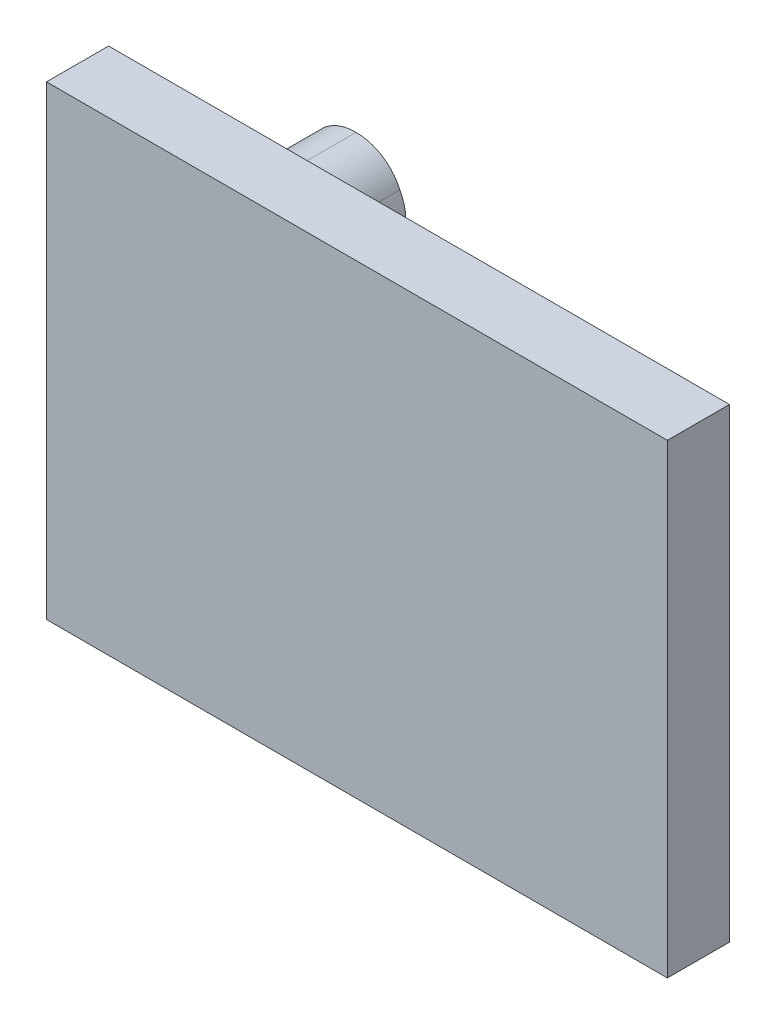
ISO-10303-21;
HEADER;
FILE_DESCRIPTION(('STEP AP214'),'2;1');
FILE_NAME('part.step','',(''),(''),'','','');
FILE_SCHEMA(('AUTOMOTIVE_DESIGN { 1 0 10303 214 1 1 1 1 }'));
ENDSEC;
DATA;
#1=APPLICATION_CONTEXT('core data for automotive mechanical design processes');
#2=APPLICATION_PROTOCOL_DEFINITION('international standard','automotive_design',2000,#1);
#3=PRODUCT_CONTEXT('',#1,'mechanical');
#4=PRODUCT('Part','Part','',(#3));
#5=PRODUCT_RELATED_PRODUCT_CATEGORY('part','',(#4));
#6=PRODUCT_DEFINITION_FORMATION('','',#4);
#7=PRODUCT_DEFINITION_CONTEXT('part definition',#1,'design');
#8=PRODUCT_DEFINITION('design','',#6,#7);
#9=PRODUCT_DEFINITION_SHAPE('','',#8);
#10=(LENGTH_UNIT() NAMED_UNIT(*) SI_UNIT(.MILLI.,.METRE.));
#11=(NAMED_UNIT(*) PLANE_ANGLE_UNIT() SI_UNIT($,.RADIAN.));
#12=(NAMED_UNIT(*) SI_UNIT($,.STERADIAN.) SOLID_ANGLE_UNIT());
#13=UNCERTAINTY_MEASURE_WITH_UNIT(LENGTH_MEASURE(1.E-05),#10,'distance_accuracy_value','');
#14=(GEOMETRIC_REPRESENTATION_CONTEXT(3) GLOBAL_UNCERTAINTY_ASSIGNED_CONTEXT((#13)) GLOBAL_UNIT_ASSIGNED_CONTEXT((#10,
#11,#12)) REPRESENTATION_CONTEXT('',''));
#15=CARTESIAN_POINT('',(0.,0.,0.));
#16=DIRECTION('',(0.,0.,1.));
#17=DIRECTION('',(1.,0.,0.));
#18=AXIS2_PLACEMENT_3D('',#15,#16,#17);
#19=CARTESIAN_POINT('',(-50.,45.6,-30.));
#20=DIRECTION('',(0.,0.,1.));
#21=DIRECTION('',(1.,0.,0.));
#22=AXIS2_PLACEMENT_3D('',#19,#20,#21);
#23=CYLINDRICAL_SURFACE('',#22,15.15);
#24=DIRECTION('',(0.,0.,1.));
#25=VECTOR('',#24,1.);
#26=CARTESIAN_POINT('',(-50.3,60.7470294117361,-15.));
#27=LINE('',#26,#25);
#28=CARTESIAN_POINT('',(-50.3,60.7470294117361,0.));
#29=VERTEX_POINT('',#28);
#30=CARTESIAN_POINT('',(-50.3,60.7470294117361,-30.));
#31=VERTEX_POINT('',#30);
#32=EDGE_CURVE('E126',#29,#31,#27,.F.);
#33=ORIENTED_EDGE('',*,*,#32,.F.);
#34=CARTESIAN_POINT('',(-50.,45.6,0.));
#35=DIRECTION('',(0.,0.,-1.));
#36=DIRECTION('',(-1.,0.,0.));
#37=AXIS2_PLACEMENT_3D('',#34,#35,#36);
#38=CIRCLE('',#37,15.15);
#39=CARTESIAN_POINT('',(-36.1627181458019,51.768640927099,0.));
#40=VERTEX_POINT('',#39);
#41=EDGE_CURVE('E135',#29,#40,#38,.T.);
#42=ORIENTED_EDGE('',*,*,#41,.T.);
#43=DIRECTION('',(0.,0.,1.));
#44=VECTOR('',#43,1.);
#45=CARTESIAN_POINT('',(-36.1627181458019,51.768640927099,-15.));
#46=LINE('',#45,#44);
#47=CARTESIAN_POINT('',(-36.1627181458019,51.768640927099,-30.));
#48=VERTEX_POINT('',#47);
#49=EDGE_CURVE('E146',#40,#48,#46,.F.);
#50=ORIENTED_EDGE('',*,*,#49,.T.);
#51=CARTESIAN_POINT('',(-50.,45.6,-30.));
#52=DIRECTION('',(0.,0.,-1.));
#53=DIRECTION('',(-1.,0.,0.));
#54=AXIS2_PLACEMENT_3D('',#51,#52,#53);
#55=CIRCLE('',#54,15.15);
#56=EDGE_CURVE('E47',#31,#48,#55,.T.);
#57=ORIENTED_EDGE('',*,*,#56,.F.);
#58=EDGE_LOOP('',(#33,#42,#50,#57));
#59=FACE_BOUND('',#58,.T.);
#60=ADVANCED_FACE('F32',(#59),#23,.T.);
#61=CARTESIAN_POINT('',(-50.6,45.,-30.));
#62=DIRECTION('',(0.,0.,1.));
#63=DIRECTION('',(1.,0.,0.));
#64=AXIS2_PLACEMENT_3D('',#61,#62,#63);
#65=CYLINDRICAL_SURFACE('',#64,15.15);
#66=DIRECTION('',(0.,0.,1.));
#67=VECTOR('',#66,1.);
#68=CARTESIAN_POINT('',(-65.7470294117362,45.3,-15.));
#69=LINE('',#68,#67);
#70=CARTESIAN_POINT('',(-65.7470294117362,45.3,-30.));
#71=VERTEX_POINT('',#70);
#72=CARTESIAN_POINT('',(-65.7470294117362,45.3,0.));
#73=VERTEX_POINT('',#72);
#74=EDGE_CURVE('E11',#71,#73,#69,.T.);
#75=ORIENTED_EDGE('',*,*,#74,.F.);
#76=CARTESIAN_POINT('',(-50.6,45.,-30.));
#77=DIRECTION('',(0.,0.,-1.));
#78=DIRECTION('',(-1.,0.,0.));
#79=AXIS2_PLACEMENT_3D('',#76,#77,#78);
#80=CIRCLE('',#79,15.15);
#81=CARTESIAN_POINT('',(-56.7686409270988,31.1627181458018,-30.));
#82=VERTEX_POINT('',#81);
#83=EDGE_CURVE('E214',#82,#71,#80,.T.);
#84=ORIENTED_EDGE('',*,*,#83,.F.);
#85=DIRECTION('',(0.,0.,1.));
#86=VECTOR('',#85,1.);
#87=CARTESIAN_POINT('',(-56.7686409270988,31.1627181458018,-15.));
#88=LINE('',#87,#86);
#89=CARTESIAN_POINT('',(-56.7686409270988,31.1627181458018,0.));
#90=VERTEX_POINT('',#89);
#91=EDGE_CURVE('E211',#82,#90,#88,.T.);
#92=ORIENTED_EDGE('',*,*,#91,.T.);
#93=CARTESIAN_POINT('',(-50.6,45.,0.));
#94=DIRECTION('',(0.,0.,-1.));
#95=DIRECTION('',(-1.,0.,0.));
#96=AXIS2_PLACEMENT_3D('',#93,#94,#95);
#97=CIRCLE('',#96,15.15);
#98=EDGE_CURVE('E217',#90,#73,#97,.T.);
#99=ORIENTED_EDGE('',*,*,#98,.T.);
#100=EDGE_LOOP('',(#75,#84,#92,#99));
#101=FACE_BOUND('',#100,.T.);
#102=ADVANCED_FACE('F226',(#101),#65,.T.);
#103=CARTESIAN_POINT('',(50.,-44.7,-30.));
#104=DIRECTION('',(0.,0.,1.));
#105=DIRECTION('',(1.,0.,0.));
#106=AXIS2_PLACEMENT_3D('',#103,#104,#105);
#107=CYLINDRICAL_SURFACE('',#106,10.15);
#108=DIRECTION('',(0.,0.,1.));
#109=VECTOR('',#108,1.);
#110=CARTESIAN_POINT('',(49.85,-34.5511084349078,-15.));
#111=LINE('',#110,#109);
#112=CARTESIAN_POINT('',(49.85,-34.5511084349078,0.));
#113=VERTEX_POINT('',#112);
#114=CARTESIAN_POINT('',(49.85,-34.5511084349078,-30.));
#115=VERTEX_POINT('',#114);
#116=EDGE_CURVE('E219',#113,#115,#111,.F.);
#117=ORIENTED_EDGE('',*,*,#116,.F.);
#118=CARTESIAN_POINT('',(50.,-44.7,0.));
#119=DIRECTION('',(0.,0.,-1.));
#120=DIRECTION('',(-1.,0.,0.));
#121=AXIS2_PLACEMENT_3D('',#118,#119,#120);
#122=CIRCLE('',#121,10.15);
#123=CARTESIAN_POINT('',(59.2234778337746,-40.4632610831126,0.));
#124=VERTEX_POINT('',#123);
#125=EDGE_CURVE('E152',#113,#124,#122,.T.);
#126=ORIENTED_EDGE('',*,*,#125,.T.);
#127=DIRECTION('',(0.,0.,1.));
#128=VECTOR('',#127,1.);
#129=CARTESIAN_POINT('',(59.2234778337746,-40.4632610831126,-15.));
#130=LINE('',#129,#128);
#131=CARTESIAN_POINT('',(59.2234778337746,-40.4632610831126,-30.));
#132=VERTEX_POINT('',#131);
#133=EDGE_CURVE('E154',#124,#132,#130,.F.);
#134=ORIENTED_EDGE('',*,*,#133,.T.);
#135=CARTESIAN_POINT('',(50.,-44.7,-30.));
#136=DIRECTION('',(0.,0.,-1.));
#137=DIRECTION('',(-1.,0.,0.));
#138=AXIS2_PLACEMENT_3D('',#135,#136,#137);
#139=CIRCLE('',#138,10.15);
#140=EDGE_CURVE('E55',#115,#132,#139,.T.);
#141=ORIENTED_EDGE('',*,*,#140,.F.);
#142=EDGE_LOOP('',(#117,#126,#134,#141));
#143=FACE_BOUND('',#142,.T.);
#144=ADVANCED_FACE('F240',(#143),#107,.T.);
#145=CARTESIAN_POINT('',(49.7,-45.,-30.));
#146=DIRECTION('',(0.,0.,1.));
#147=DIRECTION('',(1.,0.,0.));
#148=AXIS2_PLACEMENT_3D('',#145,#146,#147);
#149=CYLINDRICAL_SURFACE('',#148,10.15);
#150=DIRECTION('',(0.,0.,1.));
#151=VECTOR('',#150,1.);
#152=CARTESIAN_POINT('',(39.5511084349078,-44.85,-15.));
#153=LINE('',#152,#151);
#154=CARTESIAN_POINT('',(39.5511084349078,-44.85,-30.));
#155=VERTEX_POINT('',#154);
#156=CARTESIAN_POINT('',(39.5511084349078,-44.85,0.));
#157=VERTEX_POINT('',#156);
#158=EDGE_CURVE('E40',#155,#157,#153,.T.);
#159=ORIENTED_EDGE('',*,*,#158,.F.);
#160=CARTESIAN_POINT('',(49.7,-45.,-30.));
#161=DIRECTION('',(0.,0.,-1.));
#162=DIRECTION('',(-1.,0.,0.));
#163=AXIS2_PLACEMENT_3D('',#160,#161,#162);
#164=CIRCLE('',#163,10.15);
#165=CARTESIAN_POINT('',(45.4632610831127,-54.2234778337747,-30.));
#166=VERTEX_POINT('',#165);
#167=EDGE_CURVE('E148',#166,#155,#164,.T.);
#168=ORIENTED_EDGE('',*,*,#167,.F.);
#169=DIRECTION('',(0.,0.,1.));
#170=VECTOR('',#169,1.);
#171=CARTESIAN_POINT('',(45.4632610831127,-54.2234778337747,-15.));
#172=LINE('',#171,#170);
#173=CARTESIAN_POINT('',(45.4632610831127,-54.2234778337747,0.));
#174=VERTEX_POINT('',#173);
#175=EDGE_CURVE('E144',#166,#174,#172,.T.);
#176=ORIENTED_EDGE('',*,*,#175,.T.);
#177=CARTESIAN_POINT('',(49.7,-45.,0.));
#178=DIRECTION('',(0.,0.,-1.));
#179=DIRECTION('',(-1.,0.,0.));
#180=AXIS2_PLACEMENT_3D('',#177,#178,#179);
#181=CIRCLE('',#180,10.15);
#182=EDGE_CURVE('E207',#174,#157,#181,.T.);
#183=ORIENTED_EDGE('',*,*,#182,.T.);
#184=EDGE_LOOP('',(#159,#168,#176,#183));
#185=FACE_BOUND('',#184,.T.);
#186=ADVANCED_FACE('F209',(#185),#149,.T.);
#187=CARTESIAN_POINT('',(-49.4,44.4,-30.));
#188=DIRECTION('',(0.,0.,1.));
#189=DIRECTION('',(1.,0.,0.));
#190=AXIS2_PLACEMENT_3D('',#187,#188,#189);
#191=CYLINDRICAL_SURFACE('',#190,15.15);
#192=ORIENTED_EDGE('',*,*,#91,.F.);
#193=CARTESIAN_POINT('',(-49.4,44.4,-30.));
#194=DIRECTION('',(0.,0.,-1.));
#195=DIRECTION('',(-1.,0.,0.));
#196=AXIS2_PLACEMENT_3D('',#193,#194,#195);
#197=CIRCLE('',#196,15.15);
#198=EDGE_CURVE('E157',#48,#82,#197,.T.);
#199=ORIENTED_EDGE('',*,*,#198,.F.);
#200=ORIENTED_EDGE('',*,*,#49,.F.);
#201=CARTESIAN_POINT('',(-49.4,44.4,0.));
#202=DIRECTION('',(0.,0.,-1.));
#203=DIRECTION('',(-1.,0.,0.));
#204=AXIS2_PLACEMENT_3D('',#201,#202,#203);
#205=CIRCLE('',#204,15.15);
#206=EDGE_CURVE('E143',#40,#90,#205,.T.);
#207=ORIENTED_EDGE('',*,*,#206,.T.);
#208=EDGE_LOOP('',(#192,#199,#200,#207));
#209=FACE_BOUND('',#208,.T.);
#210=ADVANCED_FACE('F229',(#209),#191,.T.);
#211=CARTESIAN_POINT('',(50.3,-45.3,-30.));
#212=DIRECTION('',(0.,0.,1.));
#213=DIRECTION('',(1.,0.,0.));
#214=AXIS2_PLACEMENT_3D('',#211,#212,#213);
#215=CYLINDRICAL_SURFACE('',#214,10.15);
#216=ORIENTED_EDGE('',*,*,#175,.F.);
#217=CARTESIAN_POINT('',(50.3,-45.3,-30.));
#218=DIRECTION('',(0.,0.,-1.));
#219=DIRECTION('',(-1.,0.,0.));
#220=AXIS2_PLACEMENT_3D('',#217,#218,#219);
#221=CIRCLE('',#220,10.15);
#222=EDGE_CURVE('E161',#132,#166,#221,.T.);
#223=ORIENTED_EDGE('',*,*,#222,.F.);
#224=ORIENTED_EDGE('',*,*,#133,.F.);
#225=CARTESIAN_POINT('',(50.3,-45.3,0.));
#226=DIRECTION('',(0.,0.,-1.));
#227=DIRECTION('',(-1.,0.,0.));
#228=AXIS2_PLACEMENT_3D('',#225,#226,#227);
#229=CIRCLE('',#228,10.15);
#230=EDGE_CURVE('E159',#124,#174,#229,.T.);
#231=ORIENTED_EDGE('',*,*,#230,.T.);
#232=EDGE_LOOP('',(#216,#223,#224,#231));
#233=FACE_BOUND('',#232,.T.);
#234=ADVANCED_FACE('F232',(#233),#215,.T.);
#235=CARTESIAN_POINT('',(100.,-75.,20.));
#236=DIRECTION('',(-1.,0.,0.));
#237=DIRECTION('',(0.,0.,1.));
#238=AXIS2_PLACEMENT_3D('',#235,#236,#237);
#239=PLANE('',#238);
#240=DIRECTION('',(0.,1.,0.));
#241=VECTOR('',#240,1.);
#242=CARTESIAN_POINT('',(100.,-75.,0.));
#243=LINE('',#242,#241);
#244=CARTESIAN_POINT('',(100.,-75.,0.));
#245=VERTEX_POINT('',#244);
#246=CARTESIAN_POINT('',(100.,75.,0.));
#247=VERTEX_POINT('',#246);
#248=EDGE_CURVE('E163',#245,#247,#243,.T.);
#249=ORIENTED_EDGE('',*,*,#248,.T.);
#250=DIRECTION('',(0.,0.,-1.));
#251=VECTOR('',#250,1.);
#252=CARTESIAN_POINT('',(100.,75.,20.));
#253=LINE('',#252,#251);
#254=CARTESIAN_POINT('',(100.,75.,20.));
#255=VERTEX_POINT('',#254);
#256=EDGE_CURVE('E192',#255,#247,#253,.T.);
#257=ORIENTED_EDGE('',*,*,#256,.F.);
#258=DIRECTION('',(0.,1.,0.));
#259=VECTOR('',#258,1.);
#260=CARTESIAN_POINT('',(100.,-75.,20.));
#261=LINE('',#260,#259);
#262=CARTESIAN_POINT('',(100.,-75.,20.));
#263=VERTEX_POINT('',#262);
#264=EDGE_CURVE('E166',#263,#255,#261,.T.);
#265=ORIENTED_EDGE('',*,*,#264,.F.);
#266=DIRECTION('',(0.,0.,-1.));
#267=VECTOR('',#266,1.);
#268=CARTESIAN_POINT('',(100.,-75.,20.));
#269=LINE('',#268,#267);
#270=EDGE_CURVE('E176',#263,#245,#269,.T.);
#271=ORIENTED_EDGE('',*,*,#270,.T.);
#272=EDGE_LOOP('',(#249,#257,#265,#271));
#273=FACE_BOUND('',#272,.T.);
#274=ADVANCED_FACE('F34',(#273),#239,.F.);
#275=CARTESIAN_POINT('',(-100.,75.,20.));
#276=DIRECTION('',(0.,-1.,0.));
#277=DIRECTION('',(0.,0.,-1.));
#278=AXIS2_PLACEMENT_3D('',#275,#276,#277);
#279=PLANE('',#278);
#280=DIRECTION('',(-1.,0.,0.));
#281=VECTOR('',#280,1.);
#282=CARTESIAN_POINT('',(-100.,75.,0.));
#283=LINE('',#282,#281);
#284=CARTESIAN_POINT('',(-100.,75.,0.));
#285=VERTEX_POINT('',#284);
#286=EDGE_CURVE('E179',#247,#285,#283,.T.);
#287=ORIENTED_EDGE('',*,*,#286,.T.);
#288=DIRECTION('',(0.,0.,-1.));
#289=VECTOR('',#288,1.);
#290=CARTESIAN_POINT('',(-100.,75.,20.));
#291=LINE('',#290,#289);
#292=CARTESIAN_POINT('',(-100.,75.,20.));
#293=VERTEX_POINT('',#292);
#294=EDGE_CURVE('E189',#293,#285,#291,.T.);
#295=ORIENTED_EDGE('',*,*,#294,.F.);
#296=DIRECTION('',(-1.,0.,0.));
#297=VECTOR('',#296,1.);
#298=CARTESIAN_POINT('',(-100.,75.,20.));
#299=LINE('',#298,#297);
#300=EDGE_CURVE('E169',#255,#293,#299,.T.);
#301=ORIENTED_EDGE('',*,*,#300,.F.);
#302=ORIENTED_EDGE('',*,*,#256,.T.);
#303=EDGE_LOOP('',(#287,#295,#301,#302));
#304=FACE_BOUND('',#303,.T.);
#305=ADVANCED_FACE('F275',(#304),#279,.F.);
#306=CARTESIAN_POINT('',(-100.,-75.,20.));
#307=DIRECTION('',(1.,0.,0.));
#308=DIRECTION('',(0.,0.,-1.));
#309=AXIS2_PLACEMENT_3D('',#306,#307,#308);
#310=PLANE('',#309);
#311=DIRECTION('',(0.,-1.,0.));
#312=VECTOR('',#311,1.);
#313=CARTESIAN_POINT('',(-100.,-75.,0.));
#314=LINE('',#313,#312);
#315=CARTESIAN_POINT('',(-100.,-75.,0.));
#316=VERTEX_POINT('',#315);
#317=EDGE_CURVE('E181',#285,#316,#314,.T.);
#318=ORIENTED_EDGE('',*,*,#317,.T.);
#319=DIRECTION('',(0.,0.,-1.));
#320=VECTOR('',#319,1.);
#321=CARTESIAN_POINT('',(-100.,-75.,20.));
#322=LINE('',#321,#320);
#323=CARTESIAN_POINT('',(-100.,-75.,20.));
#324=VERTEX_POINT('',#323);
#325=EDGE_CURVE('E186',#324,#316,#322,.T.);
#326=ORIENTED_EDGE('',*,*,#325,.F.);
#327=DIRECTION('',(0.,-1.,0.));
#328=VECTOR('',#327,1.);
#329=CARTESIAN_POINT('',(-100.,-75.,20.));
#330=LINE('',#329,#328);
#331=EDGE_CURVE('E172',#293,#324,#330,.T.);
#332=ORIENTED_EDGE('',*,*,#331,.F.);
#333=ORIENTED_EDGE('',*,*,#294,.T.);
#334=EDGE_LOOP('',(#318,#326,#332,#333));
#335=FACE_BOUND('',#334,.T.);
#336=ADVANCED_FACE('F272',(#335),#310,.F.);
#337=CARTESIAN_POINT('',(-100.,-75.,20.));
#338=DIRECTION('',(0.,1.,0.));
#339=DIRECTION('',(0.,0.,1.));
#340=AXIS2_PLACEMENT_3D('',#337,#338,#339);
#341=PLANE('',#340);
#342=DIRECTION('',(1.,0.,0.));
#343=VECTOR('',#342,1.);
#344=CARTESIAN_POINT('',(-100.,-75.,0.));
#345=LINE('',#344,#343);
#346=EDGE_CURVE('E170',#316,#245,#345,.T.);
#347=ORIENTED_EDGE('',*,*,#346,.T.);
#348=ORIENTED_EDGE('',*,*,#270,.F.);
#349=DIRECTION('',(1.,0.,0.));
#350=VECTOR('',#349,1.);
#351=CARTESIAN_POINT('',(-100.,-75.,20.));
#352=LINE('',#351,#350);
#353=EDGE_CURVE('E174',#324,#263,#352,.T.);
#354=ORIENTED_EDGE('',*,*,#353,.F.);
#355=ORIENTED_EDGE('',*,*,#325,.T.);
#356=EDGE_LOOP('',(#347,#348,#354,#355));
#357=FACE_BOUND('',#356,.T.);
#358=ADVANCED_FACE('F267',(#357),#341,.F.);
#359=CARTESIAN_POINT('',(0.,0.,20.));
#360=DIRECTION('',(0.,0.,-1.));
#361=DIRECTION('',(-1.,0.,0.));
#362=AXIS2_PLACEMENT_3D('',#359,#360,#361);
#363=PLANE('',#362);
#364=ORIENTED_EDGE('',*,*,#264,.T.);
#365=ORIENTED_EDGE('',*,*,#300,.T.);
#366=ORIENTED_EDGE('',*,*,#331,.T.);
#367=ORIENTED_EDGE('',*,*,#353,.T.);
#368=EDGE_LOOP('',(#364,#365,#366,#367));
#369=FACE_BOUND('',#368,.T.);
#370=ADVANCED_FACE('F263',(#369),#363,.F.);
#371=CARTESIAN_POINT('',(0.,0.,0.));
#372=DIRECTION('',(0.,0.,-1.));
#373=DIRECTION('',(-1.,0.,0.));
#374=AXIS2_PLACEMENT_3D('',#371,#372,#373);
#375=PLANE('',#374);
#376=ORIENTED_EDGE('',*,*,#41,.F.);
#377=CARTESIAN_POINT('',(-50.6,45.6,0.));
#378=DIRECTION('',(0.,0.,-1.));
#379=DIRECTION('',(-1.,0.,0.));
#380=AXIS2_PLACEMENT_3D('',#377,#378,#379);
#381=CIRCLE('',#380,15.15);
#382=EDGE_CURVE('E123',#73,#29,#381,.T.);
#383=ORIENTED_EDGE('',*,*,#382,.F.);
#384=ORIENTED_EDGE('',*,*,#98,.F.);
#385=ORIENTED_EDGE('',*,*,#206,.F.);
#386=EDGE_LOOP('',(#376,#383,#384,#385));
#387=FACE_BOUND('',#386,.T.);
#388=ORIENTED_EDGE('',*,*,#125,.F.);
#389=CARTESIAN_POINT('',(49.7,-44.7,0.));
#390=DIRECTION('',(0.,0.,-1.));
#391=DIRECTION('',(-1.,0.,0.));
#392=AXIS2_PLACEMENT_3D('',#389,#390,#391);
#393=CIRCLE('',#392,10.15);
#394=EDGE_CURVE('E137',#157,#113,#393,.T.);
#395=ORIENTED_EDGE('',*,*,#394,.F.);
#396=ORIENTED_EDGE('',*,*,#182,.F.);
#397=ORIENTED_EDGE('',*,*,#230,.F.);
#398=EDGE_LOOP('',(#388,#395,#396,#397));
#399=FACE_BOUND('',#398,.T.);
#400=ORIENTED_EDGE('',*,*,#248,.F.);
#401=ORIENTED_EDGE('',*,*,#346,.F.);
#402=ORIENTED_EDGE('',*,*,#317,.F.);
#403=ORIENTED_EDGE('',*,*,#286,.F.);
#404=EDGE_LOOP('',(#400,#401,#402,#403));
#405=FACE_BOUND('',#404,.T.);
#406=ADVANCED_FACE('F140',(#387,#399,#405),#375,.T.);
#407=CARTESIAN_POINT('',(50.3,-45.3,-30.));
#408=DIRECTION('',(0.,0.,-1.));
#409=DIRECTION('',(-1.,0.,0.));
#410=AXIS2_PLACEMENT_3D('',#407,#408,#409);
#411=PLANE('',#410);
#412=CARTESIAN_POINT('',(49.7,-44.7,-30.));
#413=DIRECTION('',(0.,0.,-1.));
#414=DIRECTION('',(-1.,0.,0.));
#415=AXIS2_PLACEMENT_3D('',#412,#413,#414);
#416=CIRCLE('',#415,10.15);
#417=EDGE_CURVE('E199',#155,#115,#416,.T.);
#418=ORIENTED_EDGE('',*,*,#417,.T.);
#419=ORIENTED_EDGE('',*,*,#140,.T.);
#420=ORIENTED_EDGE('',*,*,#222,.T.);
#421=ORIENTED_EDGE('',*,*,#167,.T.);
#422=EDGE_LOOP('',(#418,#419,#420,#421));
#423=FACE_BOUND('',#422,.T.);
#424=ADVANCED_FACE('F254',(#423),#411,.T.);
#425=CARTESIAN_POINT('',(-49.4,44.4,-30.));
#426=DIRECTION('',(0.,0.,-1.));
#427=DIRECTION('',(-1.,0.,0.));
#428=AXIS2_PLACEMENT_3D('',#425,#426,#427);
#429=PLANE('',#428);
#430=CARTESIAN_POINT('',(-50.6,45.6,-30.));
#431=DIRECTION('',(0.,0.,-1.));
#432=DIRECTION('',(-1.,0.,0.));
#433=AXIS2_PLACEMENT_3D('',#430,#431,#432);
#434=CIRCLE('',#433,15.15);
#435=EDGE_CURVE('E132',#71,#31,#434,.T.);
#436=ORIENTED_EDGE('',*,*,#435,.T.);
#437=ORIENTED_EDGE('',*,*,#56,.T.);
#438=ORIENTED_EDGE('',*,*,#198,.T.);
#439=ORIENTED_EDGE('',*,*,#83,.T.);
#440=EDGE_LOOP('',(#436,#437,#438,#439));
#441=FACE_BOUND('',#440,.T.);
#442=ADVANCED_FACE('F224',(#441),#429,.T.);
#443=CARTESIAN_POINT('',(49.7,-44.7,-30.));
#444=DIRECTION('',(0.,0.,1.));
#445=DIRECTION('',(1.,0.,0.));
#446=AXIS2_PLACEMENT_3D('',#443,#444,#445);
#447=CYLINDRICAL_SURFACE('',#446,10.15);
#448=ORIENTED_EDGE('',*,*,#394,.T.);
#449=ORIENTED_EDGE('',*,*,#116,.T.);
#450=ORIENTED_EDGE('',*,*,#417,.F.);
#451=ORIENTED_EDGE('',*,*,#158,.T.);
#452=EDGE_LOOP('',(#448,#449,#450,#451));
#453=FACE_BOUND('',#452,.T.);
#454=ADVANCED_FACE('F197',(#453),#447,.T.);
#455=CARTESIAN_POINT('',(-50.6,45.6,-30.));
#456=DIRECTION('',(0.,0.,1.));
#457=DIRECTION('',(1.,0.,0.));
#458=AXIS2_PLACEMENT_3D('',#455,#456,#457);
#459=CYLINDRICAL_SURFACE('',#458,15.15);
#460=ORIENTED_EDGE('',*,*,#382,.T.);
#461=ORIENTED_EDGE('',*,*,#32,.T.);
#462=ORIENTED_EDGE('',*,*,#435,.F.);
#463=ORIENTED_EDGE('',*,*,#74,.T.);
#464=EDGE_LOOP('',(#460,#461,#462,#463));
#465=FACE_BOUND('',#464,.T.);
#466=ADVANCED_FACE('F125',(#465),#459,.T.);
#467=CLOSED_SHELL('',(#60,#102,#144,#186,#210,#234,#274,#305,#336,#358,#370,#406,#424,#442,#454,#466));
#468=MANIFOLD_SOLID_BREP('B2',#467);
#469=ADVANCED_BREP_SHAPE_REPRESENTATION('',(#18,#468),#14);
#470=SHAPE_DEFINITION_REPRESENTATION(#9,#469);
ENDSEC;
END-ISO-10303-21;
